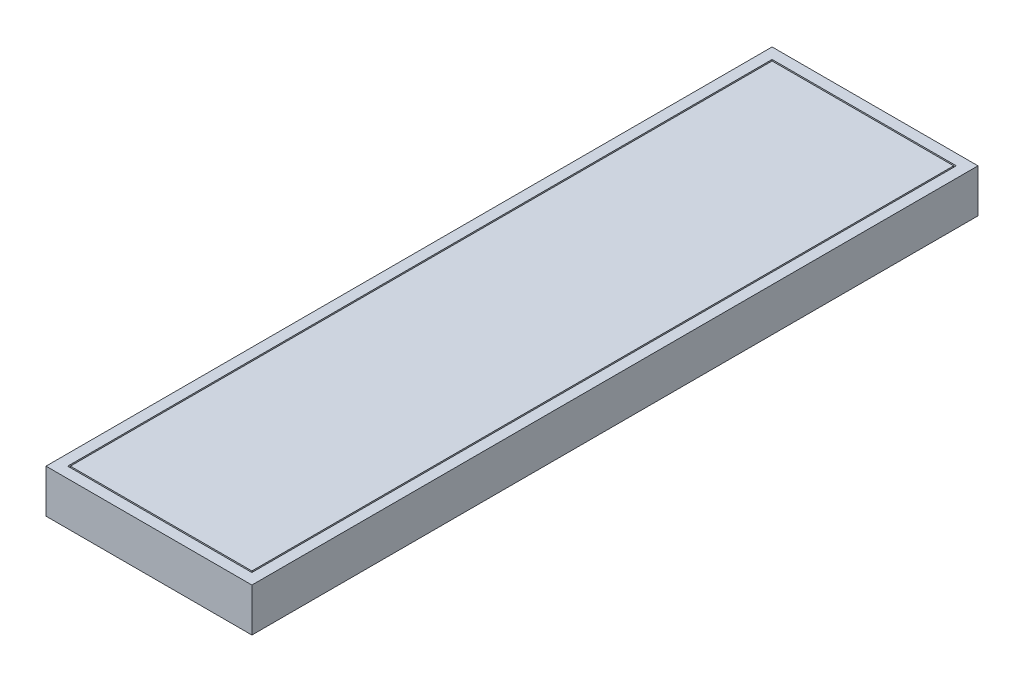
ISO-10303-21;
HEADER;
FILE_DESCRIPTION(('STEP AP214'),'2;1');
FILE_NAME('part.step','',(''),(''),'','','');
FILE_SCHEMA(('AUTOMOTIVE_DESIGN { 1 0 10303 214 1 1 1 1 }'));
ENDSEC;
DATA;
#1=APPLICATION_CONTEXT('core data for automotive mechanical design processes');
#2=APPLICATION_PROTOCOL_DEFINITION('international standard','automotive_design',2000,#1);
#3=PRODUCT_CONTEXT('',#1,'mechanical');
#4=PRODUCT('Part','Part','',(#3));
#5=PRODUCT_RELATED_PRODUCT_CATEGORY('part','',(#4));
#6=PRODUCT_DEFINITION_FORMATION('','',#4);
#7=PRODUCT_DEFINITION_CONTEXT('part definition',#1,'design');
#8=PRODUCT_DEFINITION('design','',#6,#7);
#9=PRODUCT_DEFINITION_SHAPE('','',#8);
#10=(LENGTH_UNIT() NAMED_UNIT(*) SI_UNIT(.MILLI.,.METRE.));
#11=(NAMED_UNIT(*) PLANE_ANGLE_UNIT() SI_UNIT($,.RADIAN.));
#12=(NAMED_UNIT(*) SI_UNIT($,.STERADIAN.) SOLID_ANGLE_UNIT());
#13=UNCERTAINTY_MEASURE_WITH_UNIT(LENGTH_MEASURE(1.E-05),#10,'distance_accuracy_value','');
#14=(GEOMETRIC_REPRESENTATION_CONTEXT(3) GLOBAL_UNCERTAINTY_ASSIGNED_CONTEXT((#13)) GLOBAL_UNIT_ASSIGNED_CONTEXT((#10,
#11,#12)) REPRESENTATION_CONTEXT('',''));
#15=CARTESIAN_POINT('',(0.,0.,0.));
#16=DIRECTION('',(0.,0.,1.));
#17=DIRECTION('',(1.,0.,0.));
#18=AXIS2_PLACEMENT_3D('',#15,#16,#17);
#19=CARTESIAN_POINT('',(0.,8.99999999999999,0.));
#20=DIRECTION('',(0.,1.,0.));
#21=DIRECTION('',(0.,0.,1.));
#22=AXIS2_PLACEMENT_3D('',#19,#20,#21);
#23=PLANE('',#22);
#24=DIRECTION('',(0.,0.,1.));
#25=VECTOR('',#24,1.);
#26=CARTESIAN_POINT('',(-170.,8.99999999999999,20.));
#27=LINE('',#26,#25);
#28=CARTESIAN_POINT('',(-170.,8.99999999999999,20.));
#29=VERTEX_POINT('',#28);
#30=CARTESIAN_POINT('',(-170.,8.99999999999999,1320.));
#31=VERTEX_POINT('',#30);
#32=EDGE_CURVE('E155',#29,#31,#27,.T.);
#33=ORIENTED_EDGE('',*,*,#32,.T.);
#34=DIRECTION('',(1.,0.,0.));
#35=VECTOR('',#34,1.);
#36=CARTESIAN_POINT('',(-170.,8.99999999999999,1320.));
#37=LINE('',#36,#35);
#38=CARTESIAN_POINT('',(170.,8.99999999999999,1320.));
#39=VERTEX_POINT('',#38);
#40=EDGE_CURVE('E158',#31,#39,#37,.T.);
#41=ORIENTED_EDGE('',*,*,#40,.T.);
#42=DIRECTION('',(0.,0.,-1.));
#43=VECTOR('',#42,1.);
#44=CARTESIAN_POINT('',(170.,8.99999999999999,1320.));
#45=LINE('',#44,#43);
#46=CARTESIAN_POINT('',(170.,8.99999999999999,20.));
#47=VERTEX_POINT('',#46);
#48=EDGE_CURVE('E162',#39,#47,#45,.T.);
#49=ORIENTED_EDGE('',*,*,#48,.T.);
#50=DIRECTION('',(-1.,0.,0.));
#51=VECTOR('',#50,1.);
#52=CARTESIAN_POINT('',(170.,8.99999999999999,20.));
#53=LINE('',#52,#51);
#54=EDGE_CURVE('E165',#47,#29,#53,.T.);
#55=ORIENTED_EDGE('',*,*,#54,.T.);
#56=EDGE_LOOP('',(#33,#41,#49,#55));
#57=FACE_BOUND('',#56,.T.);
#58=DIRECTION('',(0.,0.,-1.));
#59=VECTOR('',#58,1.);
#60=CARTESIAN_POINT('',(167.5,8.99999999999999,22.5));
#61=LINE('',#60,#59);
#62=CARTESIAN_POINT('',(167.5,8.99999999999999,1317.5));
#63=VERTEX_POINT('',#62);
#64=CARTESIAN_POINT('',(167.5,8.99999999999999,22.5));
#65=VERTEX_POINT('',#64);
#66=EDGE_CURVE('E372',#63,#65,#61,.T.);
#67=ORIENTED_EDGE('',*,*,#66,.F.);
#68=DIRECTION('',(1.,0.,0.));
#69=VECTOR('',#68,1.);
#70=CARTESIAN_POINT('',(167.5,8.99999999999999,1317.5));
#71=LINE('',#70,#69);
#72=CARTESIAN_POINT('',(-167.5,8.99999999999999,1317.5));
#73=VERTEX_POINT('',#72);
#74=EDGE_CURVE('E147',#73,#63,#71,.T.);
#75=ORIENTED_EDGE('',*,*,#74,.F.);
#76=DIRECTION('',(0.,0.,1.));
#77=VECTOR('',#76,1.);
#78=CARTESIAN_POINT('',(-167.5,8.99999999999999,1317.5));
#79=LINE('',#78,#77);
#80=CARTESIAN_POINT('',(-167.5,8.99999999999999,22.5));
#81=VERTEX_POINT('',#80);
#82=EDGE_CURVE('E143',#81,#73,#79,.T.);
#83=ORIENTED_EDGE('',*,*,#82,.F.);
#84=DIRECTION('',(-1.,0.,0.));
#85=VECTOR('',#84,1.);
#86=CARTESIAN_POINT('',(-167.5,8.99999999999999,22.5));
#87=LINE('',#86,#85);
#88=EDGE_CURVE('E369',#65,#81,#87,.T.);
#89=ORIENTED_EDGE('',*,*,#88,.F.);
#90=EDGE_LOOP('',(#67,#75,#83,#89));
#91=FACE_BOUND('',#90,.T.);
#92=ADVANCED_FACE('F34',(#57,#91),#23,.T.);
#93=CARTESIAN_POINT('',(-190.,20.,1340.));
#94=DIRECTION('',(-1.,0.,0.));
#95=DIRECTION('',(0.,0.,1.));
#96=AXIS2_PLACEMENT_3D('',#93,#94,#95);
#97=PLANE('',#96);
#98=DIRECTION('',(0.,0.,-1.));
#99=VECTOR('',#98,1.);
#100=CARTESIAN_POINT('',(-190.,-60.,1340.));
#101=LINE('',#100,#99);
#102=CARTESIAN_POINT('',(-190.,-60.,1340.));
#103=VERTEX_POINT('',#102);
#104=CARTESIAN_POINT('',(-190.,-60.,0.));
#105=VERTEX_POINT('',#104);
#106=EDGE_CURVE('E178',#103,#105,#101,.T.);
#107=ORIENTED_EDGE('',*,*,#106,.F.);
#108=DIRECTION('',(0.,-1.,0.));
#109=VECTOR('',#108,1.);
#110=CARTESIAN_POINT('',(-190.,20.,1340.));
#111=LINE('',#110,#109);
#112=CARTESIAN_POINT('',(-190.,20.,1340.));
#113=VERTEX_POINT('',#112);
#114=EDGE_CURVE('E11',#113,#103,#111,.T.);
#115=ORIENTED_EDGE('',*,*,#114,.F.);
#116=DIRECTION('',(0.,0.,-1.));
#117=VECTOR('',#116,1.);
#118=CARTESIAN_POINT('',(-190.,20.,1340.));
#119=LINE('',#118,#117);
#120=CARTESIAN_POINT('',(-190.,20.,0.));
#121=VERTEX_POINT('',#120);
#122=EDGE_CURVE('E184',#113,#121,#119,.T.);
#123=ORIENTED_EDGE('',*,*,#122,.T.);
#124=DIRECTION('',(0.,-1.,0.));
#125=VECTOR('',#124,1.);
#126=CARTESIAN_POINT('',(-190.,20.,0.));
#127=LINE('',#126,#125);
#128=EDGE_CURVE('E38',#121,#105,#127,.T.);
#129=ORIENTED_EDGE('',*,*,#128,.T.);
#130=EDGE_LOOP('',(#107,#115,#123,#129));
#131=FACE_BOUND('',#130,.T.);
#132=ADVANCED_FACE('F36',(#131),#97,.T.);
#133=CARTESIAN_POINT('',(190.,20.,1340.));
#134=DIRECTION('',(0.,0.,1.));
#135=DIRECTION('',(1.,0.,0.));
#136=AXIS2_PLACEMENT_3D('',#133,#134,#135);
#137=PLANE('',#136);
#138=DIRECTION('',(-1.,0.,0.));
#139=VECTOR('',#138,1.);
#140=CARTESIAN_POINT('',(190.,-60.,1340.));
#141=LINE('',#140,#139);
#142=CARTESIAN_POINT('',(190.,-60.,1340.));
#143=VERTEX_POINT('',#142);
#144=EDGE_CURVE('E188',#143,#103,#141,.T.);
#145=ORIENTED_EDGE('',*,*,#144,.F.);
#146=DIRECTION('',(0.,-1.,0.));
#147=VECTOR('',#146,1.);
#148=CARTESIAN_POINT('',(190.,20.,1340.));
#149=LINE('',#148,#147);
#150=CARTESIAN_POINT('',(190.,20.,1340.));
#151=VERTEX_POINT('',#150);
#152=EDGE_CURVE('E43',#151,#143,#149,.T.);
#153=ORIENTED_EDGE('',*,*,#152,.F.);
#154=DIRECTION('',(-1.,0.,0.));
#155=VECTOR('',#154,1.);
#156=CARTESIAN_POINT('',(190.,20.,1340.));
#157=LINE('',#156,#155);
#158=EDGE_CURVE('E194',#151,#113,#157,.T.);
#159=ORIENTED_EDGE('',*,*,#158,.T.);
#160=ORIENTED_EDGE('',*,*,#114,.T.);
#161=EDGE_LOOP('',(#145,#153,#159,#160));
#162=FACE_BOUND('',#161,.T.);
#163=ADVANCED_FACE('F220',(#162),#137,.T.);
#164=CARTESIAN_POINT('',(190.,20.,0.));
#165=DIRECTION('',(1.,0.,0.));
#166=DIRECTION('',(0.,0.,-1.));
#167=AXIS2_PLACEMENT_3D('',#164,#165,#166);
#168=PLANE('',#167);
#169=DIRECTION('',(0.,0.,1.));
#170=VECTOR('',#169,1.);
#171=CARTESIAN_POINT('',(190.,-60.,0.));
#172=LINE('',#171,#170);
#173=CARTESIAN_POINT('',(190.,-60.,0.));
#174=VERTEX_POINT('',#173);
#175=EDGE_CURVE('E202',#174,#143,#172,.T.);
#176=ORIENTED_EDGE('',*,*,#175,.F.);
#177=DIRECTION('',(0.,-1.,0.));
#178=VECTOR('',#177,1.);
#179=CARTESIAN_POINT('',(190.,20.,0.));
#180=LINE('',#179,#178);
#181=CARTESIAN_POINT('',(190.,20.,0.));
#182=VERTEX_POINT('',#181);
#183=EDGE_CURVE('E207',#182,#174,#180,.T.);
#184=ORIENTED_EDGE('',*,*,#183,.F.);
#185=DIRECTION('',(0.,0.,1.));
#186=VECTOR('',#185,1.);
#187=CARTESIAN_POINT('',(190.,20.,0.));
#188=LINE('',#187,#186);
#189=EDGE_CURVE('E191',#182,#151,#188,.T.);
#190=ORIENTED_EDGE('',*,*,#189,.T.);
#191=ORIENTED_EDGE('',*,*,#152,.T.);
#192=EDGE_LOOP('',(#176,#184,#190,#191));
#193=FACE_BOUND('',#192,.T.);
#194=ADVANCED_FACE('F226',(#193),#168,.T.);
#195=CARTESIAN_POINT('',(-190.,20.,0.));
#196=DIRECTION('',(0.,0.,-1.));
#197=DIRECTION('',(-1.,0.,0.));
#198=AXIS2_PLACEMENT_3D('',#195,#196,#197);
#199=PLANE('',#198);
#200=DIRECTION('',(1.,0.,0.));
#201=VECTOR('',#200,1.);
#202=CARTESIAN_POINT('',(-190.,-60.,0.));
#203=LINE('',#202,#201);
#204=EDGE_CURVE('E199',#105,#174,#203,.T.);
#205=ORIENTED_EDGE('',*,*,#204,.F.);
#206=ORIENTED_EDGE('',*,*,#128,.F.);
#207=DIRECTION('',(1.,0.,0.));
#208=VECTOR('',#207,1.);
#209=CARTESIAN_POINT('',(-190.,20.,0.));
#210=LINE('',#209,#208);
#211=EDGE_CURVE('E187',#121,#182,#210,.T.);
#212=ORIENTED_EDGE('',*,*,#211,.T.);
#213=ORIENTED_EDGE('',*,*,#183,.T.);
#214=EDGE_LOOP('',(#205,#206,#212,#213));
#215=FACE_BOUND('',#214,.T.);
#216=ADVANCED_FACE('F215',(#215),#199,.T.);
#217=CARTESIAN_POINT('',(0.,20.,0.));
#218=DIRECTION('',(0.,-1.,0.));
#219=DIRECTION('',(0.,0.,-1.));
#220=AXIS2_PLACEMENT_3D('',#217,#218,#219);
#221=PLANE('',#220);
#222=DIRECTION('',(1.,0.,0.));
#223=VECTOR('',#222,1.);
#224=CARTESIAN_POINT('',(-170.,20.,1320.));
#225=LINE('',#224,#223);
#226=CARTESIAN_POINT('',(-170.,20.,1320.));
#227=VERTEX_POINT('',#226);
#228=CARTESIAN_POINT('',(170.,20.,1320.));
#229=VERTEX_POINT('',#228);
#230=EDGE_CURVE('E150',#227,#229,#225,.T.);
#231=ORIENTED_EDGE('',*,*,#230,.F.);
#232=DIRECTION('',(0.,0.,1.));
#233=VECTOR('',#232,1.);
#234=CARTESIAN_POINT('',(-170.,20.,20.));
#235=LINE('',#234,#233);
#236=CARTESIAN_POINT('',(-170.,20.,20.));
#237=VERTEX_POINT('',#236);
#238=EDGE_CURVE('E59',#237,#227,#235,.T.);
#239=ORIENTED_EDGE('',*,*,#238,.F.);
#240=DIRECTION('',(-1.,0.,0.));
#241=VECTOR('',#240,1.);
#242=CARTESIAN_POINT('',(170.,20.,20.));
#243=LINE('',#242,#241);
#244=CARTESIAN_POINT('',(170.,20.,20.));
#245=VERTEX_POINT('',#244);
#246=EDGE_CURVE('E159',#245,#237,#243,.T.);
#247=ORIENTED_EDGE('',*,*,#246,.F.);
#248=DIRECTION('',(0.,0.,-1.));
#249=VECTOR('',#248,1.);
#250=CARTESIAN_POINT('',(170.,20.,1320.));
#251=LINE('',#250,#249);
#252=EDGE_CURVE('E171',#229,#245,#251,.T.);
#253=ORIENTED_EDGE('',*,*,#252,.F.);
#254=EDGE_LOOP('',(#231,#239,#247,#253));
#255=FACE_BOUND('',#254,.T.);
#256=ORIENTED_EDGE('',*,*,#122,.F.);
#257=ORIENTED_EDGE('',*,*,#158,.F.);
#258=ORIENTED_EDGE('',*,*,#189,.F.);
#259=ORIENTED_EDGE('',*,*,#211,.F.);
#260=EDGE_LOOP('',(#256,#257,#258,#259));
#261=FACE_BOUND('',#260,.T.);
#262=ADVANCED_FACE('F223',(#255,#261),#221,.F.);
#263=CARTESIAN_POINT('',(0.,-60.,0.));
#264=DIRECTION('',(0.,-1.,0.));
#265=DIRECTION('',(0.,0.,-1.));
#266=AXIS2_PLACEMENT_3D('',#263,#264,#265);
#267=PLANE('',#266);
#268=ORIENTED_EDGE('',*,*,#106,.T.);
#269=ORIENTED_EDGE('',*,*,#204,.T.);
#270=ORIENTED_EDGE('',*,*,#175,.T.);
#271=ORIENTED_EDGE('',*,*,#144,.T.);
#272=EDGE_LOOP('',(#268,#269,#270,#271));
#273=FACE_BOUND('',#272,.T.);
#274=ADVANCED_FACE('F217',(#273),#267,.T.);
#275=CARTESIAN_POINT('',(-170.,8.99999999999999,20.));
#276=DIRECTION('',(-1.,0.,0.));
#277=DIRECTION('',(0.,0.,1.));
#278=AXIS2_PLACEMENT_3D('',#275,#276,#277);
#279=PLANE('',#278);
#280=ORIENTED_EDGE('',*,*,#238,.T.);
#281=DIRECTION('',(0.,1.,0.));
#282=VECTOR('',#281,1.);
#283=CARTESIAN_POINT('',(-170.,8.99999999999999,1320.));
#284=LINE('',#283,#282);
#285=EDGE_CURVE('E167',#31,#227,#284,.T.);
#286=ORIENTED_EDGE('',*,*,#285,.F.);
#287=ORIENTED_EDGE('',*,*,#32,.F.);
#288=DIRECTION('',(0.,1.,0.));
#289=VECTOR('',#288,1.);
#290=CARTESIAN_POINT('',(-170.,8.99999999999999,20.));
#291=LINE('',#290,#289);
#292=EDGE_CURVE('E176',#29,#237,#291,.T.);
#293=ORIENTED_EDGE('',*,*,#292,.T.);
#294=EDGE_LOOP('',(#280,#286,#287,#293));
#295=FACE_BOUND('',#294,.T.);
#296=ADVANCED_FACE('F248',(#295),#279,.F.);
#297=CARTESIAN_POINT('',(170.,8.99999999999999,20.));
#298=DIRECTION('',(0.,0.,-1.));
#299=DIRECTION('',(-1.,0.,0.));
#300=AXIS2_PLACEMENT_3D('',#297,#298,#299);
#301=PLANE('',#300);
#302=ORIENTED_EDGE('',*,*,#246,.T.);
#303=ORIENTED_EDGE('',*,*,#292,.F.);
#304=ORIENTED_EDGE('',*,*,#54,.F.);
#305=DIRECTION('',(0.,1.,0.));
#306=VECTOR('',#305,1.);
#307=CARTESIAN_POINT('',(170.,8.99999999999999,20.));
#308=LINE('',#307,#306);
#309=EDGE_CURVE('E179',#47,#245,#308,.T.);
#310=ORIENTED_EDGE('',*,*,#309,.T.);
#311=EDGE_LOOP('',(#302,#303,#304,#310));
#312=FACE_BOUND('',#311,.T.);
#313=ADVANCED_FACE('F244',(#312),#301,.F.);
#314=CARTESIAN_POINT('',(170.,8.99999999999999,1320.));
#315=DIRECTION('',(1.,0.,0.));
#316=DIRECTION('',(0.,0.,-1.));
#317=AXIS2_PLACEMENT_3D('',#314,#315,#316);
#318=PLANE('',#317);
#319=ORIENTED_EDGE('',*,*,#252,.T.);
#320=ORIENTED_EDGE('',*,*,#309,.F.);
#321=ORIENTED_EDGE('',*,*,#48,.F.);
#322=DIRECTION('',(0.,1.,0.));
#323=VECTOR('',#322,1.);
#324=CARTESIAN_POINT('',(170.,8.99999999999999,1320.));
#325=LINE('',#324,#323);
#326=EDGE_CURVE('E181',#39,#229,#325,.T.);
#327=ORIENTED_EDGE('',*,*,#326,.T.);
#328=EDGE_LOOP('',(#319,#320,#321,#327));
#329=FACE_BOUND('',#328,.T.);
#330=ADVANCED_FACE('F247',(#329),#318,.F.);
#331=CARTESIAN_POINT('',(-170.,8.99999999999999,1320.));
#332=DIRECTION('',(0.,0.,1.));
#333=DIRECTION('',(1.,0.,0.));
#334=AXIS2_PLACEMENT_3D('',#331,#332,#333);
#335=PLANE('',#334);
#336=ORIENTED_EDGE('',*,*,#230,.T.);
#337=ORIENTED_EDGE('',*,*,#326,.F.);
#338=ORIENTED_EDGE('',*,*,#40,.F.);
#339=ORIENTED_EDGE('',*,*,#285,.T.);
#340=EDGE_LOOP('',(#336,#337,#338,#339));
#341=FACE_BOUND('',#340,.T.);
#342=ADVANCED_FACE('F252',(#341),#335,.F.);
#343=CARTESIAN_POINT('',(167.5,20.,1317.5));
#344=DIRECTION('',(0.,0.,-1.));
#345=DIRECTION('',(-1.,0.,0.));
#346=AXIS2_PLACEMENT_3D('',#343,#344,#345);
#347=PLANE('',#346);
#348=ORIENTED_EDGE('',*,*,#74,.T.);
#349=DIRECTION('',(0.,-1.,0.));
#350=VECTOR('',#349,1.);
#351=CARTESIAN_POINT('',(167.5,20.,1317.5));
#352=LINE('',#351,#350);
#353=CARTESIAN_POINT('',(167.5,20.,1317.5));
#354=VERTEX_POINT('',#353);
#355=EDGE_CURVE('E128',#354,#63,#352,.T.);
#356=ORIENTED_EDGE('',*,*,#355,.F.);
#357=DIRECTION('',(1.,0.,0.));
#358=VECTOR('',#357,1.);
#359=CARTESIAN_POINT('',(167.5,20.,1317.5));
#360=LINE('',#359,#358);
#361=CARTESIAN_POINT('',(-167.5,20.,1317.5));
#362=VERTEX_POINT('',#361);
#363=EDGE_CURVE('E135',#362,#354,#360,.T.);
#364=ORIENTED_EDGE('',*,*,#363,.F.);
#365=DIRECTION('',(0.,-1.,0.));
#366=VECTOR('',#365,1.);
#367=CARTESIAN_POINT('',(-167.5,20.,1317.5));
#368=LINE('',#367,#366);
#369=EDGE_CURVE('E367',#362,#73,#368,.T.);
#370=ORIENTED_EDGE('',*,*,#369,.T.);
#371=EDGE_LOOP('',(#348,#356,#364,#370));
#372=FACE_BOUND('',#371,.T.);
#373=ADVANCED_FACE('F145',(#372),#347,.F.);
#374=CARTESIAN_POINT('',(167.5,20.,22.5));
#375=DIRECTION('',(-1.,0.,0.));
#376=DIRECTION('',(0.,0.,1.));
#377=AXIS2_PLACEMENT_3D('',#374,#375,#376);
#378=PLANE('',#377);
#379=ORIENTED_EDGE('',*,*,#66,.T.);
#380=DIRECTION('',(0.,-1.,0.));
#381=VECTOR('',#380,1.);
#382=CARTESIAN_POINT('',(167.5,20.,22.5));
#383=LINE('',#382,#381);
#384=CARTESIAN_POINT('',(167.5,20.,22.5));
#385=VERTEX_POINT('',#384);
#386=EDGE_CURVE('E131',#385,#65,#383,.T.);
#387=ORIENTED_EDGE('',*,*,#386,.F.);
#388=DIRECTION('',(0.,0.,-1.));
#389=VECTOR('',#388,1.);
#390=CARTESIAN_POINT('',(167.5,20.,22.5));
#391=LINE('',#390,#389);
#392=EDGE_CURVE('E124',#354,#385,#391,.T.);
#393=ORIENTED_EDGE('',*,*,#392,.F.);
#394=ORIENTED_EDGE('',*,*,#355,.T.);
#395=EDGE_LOOP('',(#379,#387,#393,#394));
#396=FACE_BOUND('',#395,.T.);
#397=ADVANCED_FACE('F126',(#396),#378,.F.);
#398=CARTESIAN_POINT('',(-167.5,20.,22.5));
#399=DIRECTION('',(0.,0.,1.));
#400=DIRECTION('',(1.,0.,0.));
#401=AXIS2_PLACEMENT_3D('',#398,#399,#400);
#402=PLANE('',#401);
#403=ORIENTED_EDGE('',*,*,#88,.T.);
#404=DIRECTION('',(0.,-1.,0.));
#405=VECTOR('',#404,1.);
#406=CARTESIAN_POINT('',(-167.5,20.,22.5));
#407=LINE('',#406,#405);
#408=CARTESIAN_POINT('',(-167.5,20.,22.5));
#409=VERTEX_POINT('',#408);
#410=EDGE_CURVE('E51',#409,#81,#407,.T.);
#411=ORIENTED_EDGE('',*,*,#410,.F.);
#412=DIRECTION('',(-1.,0.,0.));
#413=VECTOR('',#412,1.);
#414=CARTESIAN_POINT('',(-167.5,20.,22.5));
#415=LINE('',#414,#413);
#416=EDGE_CURVE('E134',#385,#409,#415,.T.);
#417=ORIENTED_EDGE('',*,*,#416,.F.);
#418=ORIENTED_EDGE('',*,*,#386,.T.);
#419=EDGE_LOOP('',(#403,#411,#417,#418));
#420=FACE_BOUND('',#419,.T.);
#421=ADVANCED_FACE('F295',(#420),#402,.F.);
#422=CARTESIAN_POINT('',(-167.5,20.,1317.5));
#423=DIRECTION('',(1.,0.,0.));
#424=DIRECTION('',(0.,0.,-1.));
#425=AXIS2_PLACEMENT_3D('',#422,#423,#424);
#426=PLANE('',#425);
#427=ORIENTED_EDGE('',*,*,#82,.T.);
#428=ORIENTED_EDGE('',*,*,#369,.F.);
#429=DIRECTION('',(0.,0.,1.));
#430=VECTOR('',#429,1.);
#431=CARTESIAN_POINT('',(-167.5,20.,1317.5));
#432=LINE('',#431,#430);
#433=EDGE_CURVE('E139',#409,#362,#432,.T.);
#434=ORIENTED_EDGE('',*,*,#433,.F.);
#435=ORIENTED_EDGE('',*,*,#410,.T.);
#436=EDGE_LOOP('',(#427,#428,#434,#435));
#437=FACE_BOUND('',#436,.T.);
#438=ADVANCED_FACE('F301',(#437),#426,.F.);
#439=CARTESIAN_POINT('',(0.,20.,0.));
#440=DIRECTION('',(0.,-1.,0.));
#441=DIRECTION('',(0.,0.,-1.));
#442=AXIS2_PLACEMENT_3D('',#439,#440,#441);
#443=PLANE('',#442);
#444=ORIENTED_EDGE('',*,*,#363,.T.);
#445=ORIENTED_EDGE('',*,*,#392,.T.);
#446=ORIENTED_EDGE('',*,*,#416,.T.);
#447=ORIENTED_EDGE('',*,*,#433,.T.);
#448=EDGE_LOOP('',(#444,#445,#446,#447));
#449=FACE_BOUND('',#448,.T.);
#450=ADVANCED_FACE('F138',(#449),#443,.F.);
#451=CLOSED_SHELL('',(#92,#132,#163,#194,#216,#262,#274,#296,#313,#330,#342,#373,#397,#421,#438,#450));
#452=MANIFOLD_SOLID_BREP('B2',#451);
#453=ADVANCED_BREP_SHAPE_REPRESENTATION('',(#18,#452),#14);
#454=SHAPE_DEFINITION_REPRESENTATION(#9,#453);
ENDSEC;
END-ISO-10303-21;
